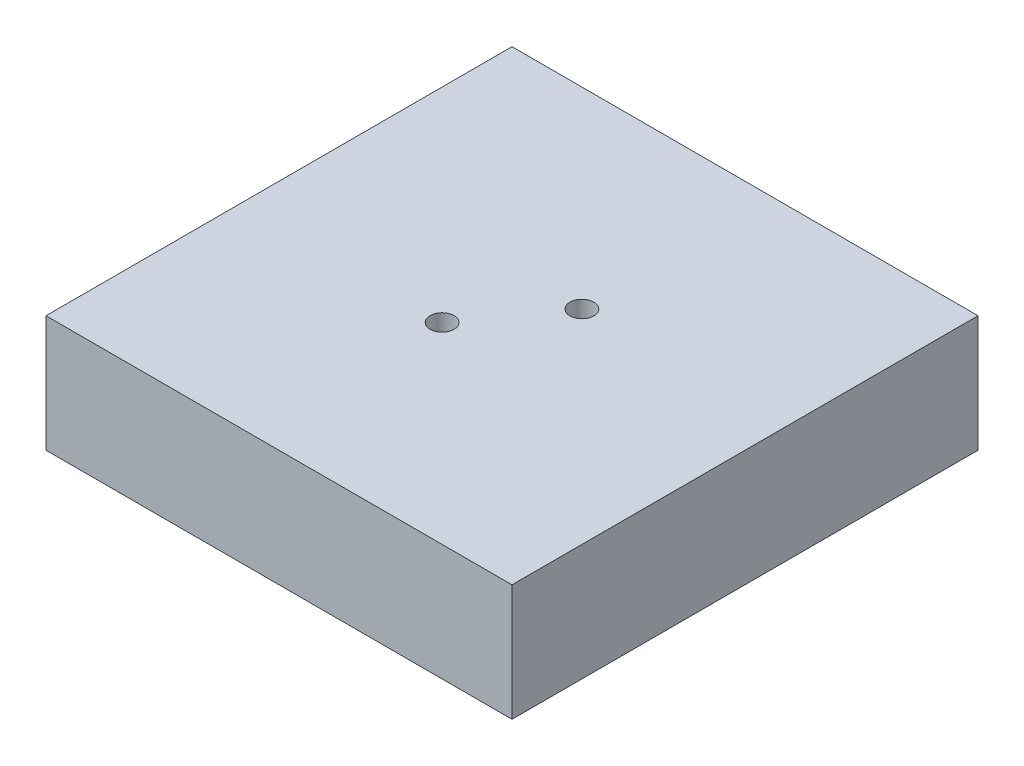
ISO-10303-21;
HEADER;
FILE_DESCRIPTION(('STEP AP214'),'2;1');
FILE_NAME('part.step','',(''),(''),'','','');
FILE_SCHEMA(('AUTOMOTIVE_DESIGN { 1 0 10303 214 1 1 1 1 }'));
ENDSEC;
DATA;
#1=APPLICATION_CONTEXT('core data for automotive mechanical design processes');
#2=APPLICATION_PROTOCOL_DEFINITION('international standard','automotive_design',2000,#1);
#3=PRODUCT_CONTEXT('',#1,'mechanical');
#4=PRODUCT('Part','Part','',(#3));
#5=PRODUCT_RELATED_PRODUCT_CATEGORY('part','',(#4));
#6=PRODUCT_DEFINITION_FORMATION('','',#4);
#7=PRODUCT_DEFINITION_CONTEXT('part definition',#1,'design');
#8=PRODUCT_DEFINITION('design','',#6,#7);
#9=PRODUCT_DEFINITION_SHAPE('','',#8);
#10=(LENGTH_UNIT() NAMED_UNIT(*) SI_UNIT(.MILLI.,.METRE.));
#11=(NAMED_UNIT(*) PLANE_ANGLE_UNIT() SI_UNIT($,.RADIAN.));
#12=(NAMED_UNIT(*) SI_UNIT($,.STERADIAN.) SOLID_ANGLE_UNIT());
#13=UNCERTAINTY_MEASURE_WITH_UNIT(LENGTH_MEASURE(1.E-05),#10,'distance_accuracy_value','');
#14=(GEOMETRIC_REPRESENTATION_CONTEXT(3) GLOBAL_UNCERTAINTY_ASSIGNED_CONTEXT((#13)) GLOBAL_UNIT_ASSIGNED_CONTEXT((#10,
#11,#12)) REPRESENTATION_CONTEXT('',''));
#15=CARTESIAN_POINT('',(0.,0.,0.));
#16=DIRECTION('',(0.,0.,1.));
#17=DIRECTION('',(1.,0.,0.));
#18=AXIS2_PLACEMENT_3D('',#15,#16,#17);
#19=CARTESIAN_POINT('',(-20.,10.,-20.));
#20=DIRECTION('',(1.,0.,0.));
#21=DIRECTION('',(0.,0.,-1.));
#22=AXIS2_PLACEMENT_3D('',#19,#20,#21);
#23=PLANE('',#22);
#24=DIRECTION('',(0.,0.,1.));
#25=VECTOR('',#24,1.);
#26=CARTESIAN_POINT('',(-20.,0.,-20.));
#27=LINE('',#26,#25);
#28=CARTESIAN_POINT('',(-20.,0.,-20.));
#29=VERTEX_POINT('',#28);
#30=CARTESIAN_POINT('',(-20.,0.,20.));
#31=VERTEX_POINT('',#30);
#32=EDGE_CURVE('E112',#29,#31,#27,.T.);
#33=ORIENTED_EDGE('',*,*,#32,.T.);
#34=DIRECTION('',(0.,-1.,0.));
#35=VECTOR('',#34,1.);
#36=CARTESIAN_POINT('',(-20.,10.,20.));
#37=LINE('',#36,#35);
#38=CARTESIAN_POINT('',(-20.,10.,20.));
#39=VERTEX_POINT('',#38);
#40=EDGE_CURVE('E13',#39,#31,#37,.T.);
#41=ORIENTED_EDGE('',*,*,#40,.F.);
#42=DIRECTION('',(0.,0.,1.));
#43=VECTOR('',#42,1.);
#44=CARTESIAN_POINT('',(-20.,10.,-20.));
#45=LINE('',#44,#43);
#46=CARTESIAN_POINT('',(-20.,10.,-20.));
#47=VERTEX_POINT('',#46);
#48=EDGE_CURVE('E100',#47,#39,#45,.T.);
#49=ORIENTED_EDGE('',*,*,#48,.F.);
#50=DIRECTION('',(0.,-1.,0.));
#51=VECTOR('',#50,1.);
#52=CARTESIAN_POINT('',(-20.,10.,-20.));
#53=LINE('',#52,#51);
#54=EDGE_CURVE('E108',#47,#29,#53,.T.);
#55=ORIENTED_EDGE('',*,*,#54,.T.);
#56=EDGE_LOOP('',(#33,#41,#49,#55));
#57=FACE_BOUND('',#56,.T.);
#58=ADVANCED_FACE('F49',(#57),#23,.F.);
#59=CARTESIAN_POINT('',(-20.,10.,20.));
#60=DIRECTION('',(0.,0.,-1.));
#61=DIRECTION('',(-1.,0.,0.));
#62=AXIS2_PLACEMENT_3D('',#59,#60,#61);
#63=PLANE('',#62);
#64=DIRECTION('',(1.,0.,0.));
#65=VECTOR('',#64,1.);
#66=CARTESIAN_POINT('',(-20.,0.,20.));
#67=LINE('',#66,#65);
#68=CARTESIAN_POINT('',(20.,0.,20.));
#69=VERTEX_POINT('',#68);
#70=EDGE_CURVE('E104',#31,#69,#67,.T.);
#71=ORIENTED_EDGE('',*,*,#70,.T.);
#72=DIRECTION('',(0.,-1.,0.));
#73=VECTOR('',#72,1.);
#74=CARTESIAN_POINT('',(20.,10.,20.));
#75=LINE('',#74,#73);
#76=CARTESIAN_POINT('',(20.,10.,20.));
#77=VERTEX_POINT('',#76);
#78=EDGE_CURVE('E57',#77,#69,#75,.T.);
#79=ORIENTED_EDGE('',*,*,#78,.F.);
#80=DIRECTION('',(1.,0.,0.));
#81=VECTOR('',#80,1.);
#82=CARTESIAN_POINT('',(-20.,10.,20.));
#83=LINE('',#82,#81);
#84=EDGE_CURVE('E95',#39,#77,#83,.T.);
#85=ORIENTED_EDGE('',*,*,#84,.F.);
#86=ORIENTED_EDGE('',*,*,#40,.T.);
#87=EDGE_LOOP('',(#71,#79,#85,#86));
#88=FACE_BOUND('',#87,.T.);
#89=ADVANCED_FACE('F103',(#88),#63,.F.);
#90=CARTESIAN_POINT('',(20.,10.,-20.));
#91=DIRECTION('',(-1.,0.,0.));
#92=DIRECTION('',(0.,0.,1.));
#93=AXIS2_PLACEMENT_3D('',#90,#91,#92);
#94=PLANE('',#93);
#95=DIRECTION('',(0.,0.,-1.));
#96=VECTOR('',#95,1.);
#97=CARTESIAN_POINT('',(20.,0.,-20.));
#98=LINE('',#97,#96);
#99=CARTESIAN_POINT('',(20.,0.,-20.));
#100=VERTEX_POINT('',#99);
#101=EDGE_CURVE('E82',#69,#100,#98,.T.);
#102=ORIENTED_EDGE('',*,*,#101,.T.);
#103=DIRECTION('',(0.,-1.,0.));
#104=VECTOR('',#103,1.);
#105=CARTESIAN_POINT('',(20.,10.,-20.));
#106=LINE('',#105,#104);
#107=CARTESIAN_POINT('',(20.,10.,-20.));
#108=VERTEX_POINT('',#107);
#109=EDGE_CURVE('E105',#108,#100,#106,.T.);
#110=ORIENTED_EDGE('',*,*,#109,.F.);
#111=DIRECTION('',(0.,0.,-1.));
#112=VECTOR('',#111,1.);
#113=CARTESIAN_POINT('',(20.,10.,-20.));
#114=LINE('',#113,#112);
#115=EDGE_CURVE('E98',#77,#108,#114,.T.);
#116=ORIENTED_EDGE('',*,*,#115,.F.);
#117=ORIENTED_EDGE('',*,*,#78,.T.);
#118=EDGE_LOOP('',(#102,#110,#116,#117));
#119=FACE_BOUND('',#118,.T.);
#120=ADVANCED_FACE('F106',(#119),#94,.F.);
#121=CARTESIAN_POINT('',(-20.,10.,-20.));
#122=DIRECTION('',(0.,0.,1.));
#123=DIRECTION('',(1.,0.,0.));
#124=AXIS2_PLACEMENT_3D('',#121,#122,#123);
#125=PLANE('',#124);
#126=DIRECTION('',(-1.,0.,0.));
#127=VECTOR('',#126,1.);
#128=CARTESIAN_POINT('',(-20.,0.,-20.));
#129=LINE('',#128,#127);
#130=EDGE_CURVE('E88',#100,#29,#129,.T.);
#131=ORIENTED_EDGE('',*,*,#130,.T.);
#132=ORIENTED_EDGE('',*,*,#54,.F.);
#133=DIRECTION('',(-1.,0.,0.));
#134=VECTOR('',#133,1.);
#135=CARTESIAN_POINT('',(-20.,10.,-20.));
#136=LINE('',#135,#134);
#137=EDGE_CURVE('E65',#108,#47,#136,.T.);
#138=ORIENTED_EDGE('',*,*,#137,.F.);
#139=ORIENTED_EDGE('',*,*,#109,.T.);
#140=EDGE_LOOP('',(#131,#132,#138,#139));
#141=FACE_BOUND('',#140,.T.);
#142=ADVANCED_FACE('F120',(#141),#125,.F.);
#143=CARTESIAN_POINT('',(0.,10.,0.));
#144=DIRECTION('',(0.,1.,0.));
#145=DIRECTION('',(0.,0.,1.));
#146=AXIS2_PLACEMENT_3D('',#143,#144,#145);
#147=PLANE('',#146);
#148=CARTESIAN_POINT('',(-2.5,10.,3.5));
#149=DIRECTION('',(0.,1.,0.));
#150=DIRECTION('',(0.,0.,1.));
#151=AXIS2_PLACEMENT_3D('',#148,#149,#150);
#152=CIRCLE('',#151,1.02499999999999);
#153=CARTESIAN_POINT('',(-2.5,10.,4.52499999999999));
#154=VERTEX_POINT('',#153);
#155=EDGE_CURVE('E134',#154,#154,#152,.T.);
#156=ORIENTED_EDGE('',*,*,#155,.F.);
#157=EDGE_LOOP('',(#156));
#158=FACE_BOUND('',#157,.T.);
#159=CARTESIAN_POINT('',(2.5,10.,-3.5));
#160=DIRECTION('',(0.,1.,0.));
#161=DIRECTION('',(0.,0.,1.));
#162=AXIS2_PLACEMENT_3D('',#159,#160,#161);
#163=CIRCLE('',#162,1.02499999999999);
#164=CARTESIAN_POINT('',(2.5,10.,-2.47500000000001));
#165=VERTEX_POINT('',#164);
#166=EDGE_CURVE('E128',#165,#165,#163,.T.);
#167=ORIENTED_EDGE('',*,*,#166,.F.);
#168=EDGE_LOOP('',(#167));
#169=FACE_BOUND('',#168,.T.);
#170=ORIENTED_EDGE('',*,*,#48,.T.);
#171=ORIENTED_EDGE('',*,*,#84,.T.);
#172=ORIENTED_EDGE('',*,*,#115,.T.);
#173=ORIENTED_EDGE('',*,*,#137,.T.);
#174=EDGE_LOOP('',(#170,#171,#172,#173));
#175=FACE_BOUND('',#174,.T.);
#176=ADVANCED_FACE('F96',(#158,#169,#175),#147,.T.);
#177=CARTESIAN_POINT('',(0.,0.,0.));
#178=DIRECTION('',(0.,1.,0.));
#179=DIRECTION('',(0.,0.,1.));
#180=AXIS2_PLACEMENT_3D('',#177,#178,#179);
#181=PLANE('',#180);
#182=CARTESIAN_POINT('',(-2.5,0.,3.5));
#183=DIRECTION('',(0.,1.,0.));
#184=DIRECTION('',(0.,0.,1.));
#185=AXIS2_PLACEMENT_3D('',#182,#183,#184);
#186=CIRCLE('',#185,1.02499999999999);
#187=CARTESIAN_POINT('',(-2.5,0.,4.52499999999999));
#188=VERTEX_POINT('',#187);
#189=EDGE_CURVE('E131',#188,#188,#186,.T.);
#190=ORIENTED_EDGE('',*,*,#189,.T.);
#191=EDGE_LOOP('',(#190));
#192=FACE_BOUND('',#191,.T.);
#193=CARTESIAN_POINT('',(2.5,0.,-3.5));
#194=DIRECTION('',(0.,1.,0.));
#195=DIRECTION('',(0.,0.,1.));
#196=AXIS2_PLACEMENT_3D('',#193,#194,#195);
#197=CIRCLE('',#196,1.02499999999999);
#198=CARTESIAN_POINT('',(2.5,0.,-2.47500000000001));
#199=VERTEX_POINT('',#198);
#200=EDGE_CURVE('E115',#199,#199,#197,.T.);
#201=ORIENTED_EDGE('',*,*,#200,.T.);
#202=EDGE_LOOP('',(#201));
#203=FACE_BOUND('',#202,.T.);
#204=ORIENTED_EDGE('',*,*,#32,.F.);
#205=ORIENTED_EDGE('',*,*,#130,.F.);
#206=ORIENTED_EDGE('',*,*,#101,.F.);
#207=ORIENTED_EDGE('',*,*,#70,.F.);
#208=EDGE_LOOP('',(#204,#205,#206,#207));
#209=FACE_BOUND('',#208,.T.);
#210=ADVANCED_FACE('F123',(#192,#203,#209),#181,.F.);
#211=CARTESIAN_POINT('',(2.5,10.,-3.5));
#212=DIRECTION('',(0.,1.,0.));
#213=DIRECTION('',(0.,0.,1.));
#214=AXIS2_PLACEMENT_3D('',#211,#212,#213);
#215=CYLINDRICAL_SURFACE('',#214,1.02499999999999);
#216=ORIENTED_EDGE('',*,*,#200,.F.);
#217=EDGE_LOOP('',(#216));
#218=FACE_BOUND('',#217,.T.);
#219=ORIENTED_EDGE('',*,*,#166,.T.);
#220=EDGE_LOOP('',(#219));
#221=FACE_BOUND('',#220,.T.);
#222=ADVANCED_FACE('F145',(#218,#221),#215,.F.);
#223=CARTESIAN_POINT('',(-2.5,10.,3.5));
#224=DIRECTION('',(0.,1.,0.));
#225=DIRECTION('',(0.,0.,1.));
#226=AXIS2_PLACEMENT_3D('',#223,#224,#225);
#227=CYLINDRICAL_SURFACE('',#226,1.02499999999999);
#228=ORIENTED_EDGE('',*,*,#189,.F.);
#229=EDGE_LOOP('',(#228));
#230=FACE_BOUND('',#229,.T.);
#231=ORIENTED_EDGE('',*,*,#155,.T.);
#232=EDGE_LOOP('',(#231));
#233=FACE_BOUND('',#232,.T.);
#234=ADVANCED_FACE('F138',(#230,#233),#227,.F.);
#235=CLOSED_SHELL('',(#58,#89,#120,#142,#176,#210,#222,#234));
#236=MANIFOLD_SOLID_BREP('B2',#235);
#237=ADVANCED_BREP_SHAPE_REPRESENTATION('',(#18,#236),#14);
#238=SHAPE_DEFINITION_REPRESENTATION(#9,#237);
ENDSEC;
END-ISO-10303-21;
